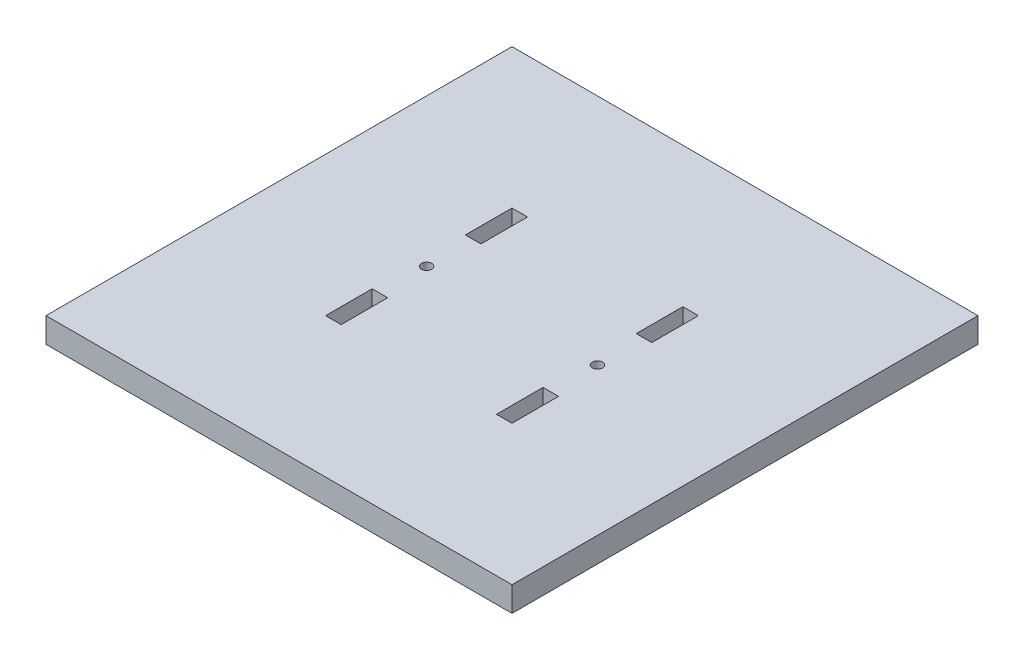
ISO-10303-21;
HEADER;
FILE_DESCRIPTION(('STEP AP214'),'2;1');
FILE_NAME('part.step','',(''),(''),'','','');
FILE_SCHEMA(('AUTOMOTIVE_DESIGN { 1 0 10303 214 1 1 1 1 }'));
ENDSEC;
DATA;
#1=APPLICATION_CONTEXT('core data for automotive mechanical design processes');
#2=APPLICATION_PROTOCOL_DEFINITION('international standard','automotive_design',2000,#1);
#3=PRODUCT_CONTEXT('',#1,'mechanical');
#4=PRODUCT('Part','Part','',(#3));
#5=PRODUCT_RELATED_PRODUCT_CATEGORY('part','',(#4));
#6=PRODUCT_DEFINITION_FORMATION('','',#4);
#7=PRODUCT_DEFINITION_CONTEXT('part definition',#1,'design');
#8=PRODUCT_DEFINITION('design','',#6,#7);
#9=PRODUCT_DEFINITION_SHAPE('','',#8);
#10=(LENGTH_UNIT() NAMED_UNIT(*) SI_UNIT(.MILLI.,.METRE.));
#11=(NAMED_UNIT(*) PLANE_ANGLE_UNIT() SI_UNIT($,.RADIAN.));
#12=(NAMED_UNIT(*) SI_UNIT($,.STERADIAN.) SOLID_ANGLE_UNIT());
#13=UNCERTAINTY_MEASURE_WITH_UNIT(LENGTH_MEASURE(1.E-05),#10,'distance_accuracy_value','');
#14=(GEOMETRIC_REPRESENTATION_CONTEXT(3) GLOBAL_UNCERTAINTY_ASSIGNED_CONTEXT((#13)) GLOBAL_UNIT_ASSIGNED_CONTEXT((#10,
#11,#12)) REPRESENTATION_CONTEXT('',''));
#15=CARTESIAN_POINT('',(0.,0.,0.));
#16=DIRECTION('',(0.,0.,1.));
#17=DIRECTION('',(1.,0.,0.));
#18=AXIS2_PLACEMENT_3D('',#15,#16,#17);
#19=CARTESIAN_POINT('',(0.,8.,-150.));
#20=DIRECTION('',(0.,-1.,0.));
#21=DIRECTION('',(0.,0.,-1.));
#22=AXIS2_PLACEMENT_3D('',#19,#20,#21);
#23=PLANE('',#22);
#24=DIRECTION('',(0.,0.,-1.));
#25=VECTOR('',#24,1.);
#26=CARTESIAN_POINT('',(50.,8.,-45.));
#27=LINE('',#26,#25);
#28=CARTESIAN_POINT('',(50.,8.,-45.));
#29=VERTEX_POINT('',#28);
#30=CARTESIAN_POINT('',(50.,8.,-60.));
#31=VERTEX_POINT('',#30);
#32=EDGE_CURVE('E203',#29,#31,#27,.T.);
#33=ORIENTED_EDGE('',*,*,#32,.F.);
#34=DIRECTION('',(1.,0.,0.));
#35=VECTOR('',#34,1.);
#36=CARTESIAN_POINT('',(50.,8.,-45.));
#37=LINE('',#36,#35);
#38=CARTESIAN_POINT('',(45.,8.,-45.));
#39=VERTEX_POINT('',#38);
#40=EDGE_CURVE('E211',#39,#29,#37,.T.);
#41=ORIENTED_EDGE('',*,*,#40,.F.);
#42=DIRECTION('',(0.,0.,1.));
#43=VECTOR('',#42,1.);
#44=CARTESIAN_POINT('',(45.,8.,-45.));
#45=LINE('',#44,#43);
#46=CARTESIAN_POINT('',(45.,8.,-60.));
#47=VERTEX_POINT('',#46);
#48=EDGE_CURVE('E208',#47,#39,#45,.T.);
#49=ORIENTED_EDGE('',*,*,#48,.F.);
#50=DIRECTION('',(-1.,0.,0.));
#51=VECTOR('',#50,1.);
#52=CARTESIAN_POINT('',(50.,8.,-60.));
#53=LINE('',#52,#51);
#54=EDGE_CURVE('E205',#31,#47,#53,.T.);
#55=ORIENTED_EDGE('',*,*,#54,.F.);
#56=EDGE_LOOP('',(#33,#41,#49,#55));
#57=FACE_BOUND('',#56,.T.);
#58=DIRECTION('',(1.,0.,0.));
#59=VECTOR('',#58,1.);
#60=CARTESIAN_POINT('',(100.,8.,-45.));
#61=LINE('',#60,#59);
#62=CARTESIAN_POINT('',(100.,8.,-45.));
#63=VERTEX_POINT('',#62);
#64=CARTESIAN_POINT('',(105.,8.,-45.));
#65=VERTEX_POINT('',#64);
#66=EDGE_CURVE('E240',#63,#65,#61,.T.);
#67=ORIENTED_EDGE('',*,*,#66,.F.);
#68=DIRECTION('',(0.,0.,1.));
#69=VECTOR('',#68,1.);
#70=CARTESIAN_POINT('',(100.,8.,-45.));
#71=LINE('',#70,#69);
#72=CARTESIAN_POINT('',(100.,8.,-60.));
#73=VERTEX_POINT('',#72);
#74=EDGE_CURVE('E248',#73,#63,#71,.T.);
#75=ORIENTED_EDGE('',*,*,#74,.F.);
#76=DIRECTION('',(-1.,0.,0.));
#77=VECTOR('',#76,1.);
#78=CARTESIAN_POINT('',(100.,8.,-60.));
#79=LINE('',#78,#77);
#80=CARTESIAN_POINT('',(105.,8.,-60.));
#81=VERTEX_POINT('',#80);
#82=EDGE_CURVE('E245',#81,#73,#79,.T.);
#83=ORIENTED_EDGE('',*,*,#82,.F.);
#84=DIRECTION('',(0.,0.,-1.));
#85=VECTOR('',#84,1.);
#86=CARTESIAN_POINT('',(105.,8.,-45.));
#87=LINE('',#86,#85);
#88=EDGE_CURVE('E242',#65,#81,#87,.T.);
#89=ORIENTED_EDGE('',*,*,#88,.F.);
#90=EDGE_LOOP('',(#67,#75,#83,#89));
#91=FACE_BOUND('',#90,.T.);
#92=DIRECTION('',(0.,0.,1.));
#93=VECTOR('',#92,1.);
#94=CARTESIAN_POINT('',(100.,8.,-105.));
#95=LINE('',#94,#93);
#96=CARTESIAN_POINT('',(100.,8.,-105.));
#97=VERTEX_POINT('',#96);
#98=CARTESIAN_POINT('',(100.,8.,-90.));
#99=VERTEX_POINT('',#98);
#100=EDGE_CURVE('E277',#97,#99,#95,.T.);
#101=ORIENTED_EDGE('',*,*,#100,.F.);
#102=DIRECTION('',(-1.,0.,0.));
#103=VECTOR('',#102,1.);
#104=CARTESIAN_POINT('',(100.,8.,-105.));
#105=LINE('',#104,#103);
#106=CARTESIAN_POINT('',(105.,8.,-105.));
#107=VERTEX_POINT('',#106);
#108=EDGE_CURVE('E285',#107,#97,#105,.T.);
#109=ORIENTED_EDGE('',*,*,#108,.F.);
#110=DIRECTION('',(0.,0.,-1.));
#111=VECTOR('',#110,1.);
#112=CARTESIAN_POINT('',(105.,8.,-105.));
#113=LINE('',#112,#111);
#114=CARTESIAN_POINT('',(105.,8.,-90.));
#115=VERTEX_POINT('',#114);
#116=EDGE_CURVE('E282',#115,#107,#113,.T.);
#117=ORIENTED_EDGE('',*,*,#116,.F.);
#118=DIRECTION('',(1.,0.,0.));
#119=VECTOR('',#118,1.);
#120=CARTESIAN_POINT('',(100.,8.,-90.));
#121=LINE('',#120,#119);
#122=EDGE_CURVE('E279',#99,#115,#121,.T.);
#123=ORIENTED_EDGE('',*,*,#122,.F.);
#124=EDGE_LOOP('',(#101,#109,#117,#123));
#125=FACE_BOUND('',#124,.T.);
#126=DIRECTION('',(0.,0.,1.));
#127=VECTOR('',#126,1.);
#128=CARTESIAN_POINT('',(0.,8.,0.));
#129=LINE('',#128,#127);
#130=CARTESIAN_POINT('',(0.,8.,-150.));
#131=VERTEX_POINT('',#130);
#132=CARTESIAN_POINT('',(0.,8.,0.));
#133=VERTEX_POINT('',#132);
#134=EDGE_CURVE('E308',#131,#133,#129,.T.);
#135=ORIENTED_EDGE('',*,*,#134,.T.);
#136=DIRECTION('',(1.,0.,0.));
#137=VECTOR('',#136,1.);
#138=CARTESIAN_POINT('',(0.,8.,0.));
#139=LINE('',#138,#137);
#140=CARTESIAN_POINT('',(150.,8.,0.));
#141=VERTEX_POINT('',#140);
#142=EDGE_CURVE('E311',#133,#141,#139,.T.);
#143=ORIENTED_EDGE('',*,*,#142,.T.);
#144=DIRECTION('',(0.,0.,-1.));
#145=VECTOR('',#144,1.);
#146=CARTESIAN_POINT('',(150.,8.,0.));
#147=LINE('',#146,#145);
#148=CARTESIAN_POINT('',(150.,8.,-150.));
#149=VERTEX_POINT('',#148);
#150=EDGE_CURVE('E314',#141,#149,#147,.T.);
#151=ORIENTED_EDGE('',*,*,#150,.T.);
#152=DIRECTION('',(-1.,0.,0.));
#153=VECTOR('',#152,1.);
#154=CARTESIAN_POINT('',(0.,8.,-150.));
#155=LINE('',#154,#153);
#156=EDGE_CURVE('E316',#149,#131,#155,.T.);
#157=ORIENTED_EDGE('',*,*,#156,.T.);
#158=EDGE_LOOP('',(#135,#143,#151,#157));
#159=FACE_BOUND('',#158,.T.);
#160=CARTESIAN_POINT('',(102.5,8.,-75.));
#161=DIRECTION('',(0.,1.,0.));
#162=DIRECTION('',(0.,0.,1.));
#163=AXIS2_PLACEMENT_3D('',#160,#161,#162);
#164=CIRCLE('',#163,1.65);
#165=CARTESIAN_POINT('',(102.5,8.,-73.35));
#166=VERTEX_POINT('',#165);
#167=EDGE_CURVE('E271',#166,#166,#164,.T.);
#168=ORIENTED_EDGE('',*,*,#167,.F.);
#169=EDGE_LOOP('',(#168));
#170=FACE_BOUND('',#169,.T.);
#171=CARTESIAN_POINT('',(47.5,8.,-75.));
#172=DIRECTION('',(0.,1.,0.));
#173=DIRECTION('',(0.,0.,-1.));
#174=AXIS2_PLACEMENT_3D('',#171,#172,#173);
#175=CIRCLE('',#174,1.65);
#176=CARTESIAN_POINT('',(47.5,8.,-76.65));
#177=VERTEX_POINT('',#176);
#178=EDGE_CURVE('E234',#177,#177,#175,.T.);
#179=ORIENTED_EDGE('',*,*,#178,.F.);
#180=EDGE_LOOP('',(#179));
#181=FACE_BOUND('',#180,.T.);
#182=DIRECTION('',(-1.,0.,0.));
#183=VECTOR('',#182,1.);
#184=CARTESIAN_POINT('',(50.,8.,-105.));
#185=LINE('',#184,#183);
#186=CARTESIAN_POINT('',(50.,8.,-105.));
#187=VERTEX_POINT('',#186);
#188=CARTESIAN_POINT('',(45.,8.,-105.));
#189=VERTEX_POINT('',#188);
#190=EDGE_CURVE('E167',#187,#189,#185,.T.);
#191=ORIENTED_EDGE('',*,*,#190,.F.);
#192=DIRECTION('',(0.,0.,-1.));
#193=VECTOR('',#192,1.);
#194=CARTESIAN_POINT('',(50.,8.,-105.));
#195=LINE('',#194,#193);
#196=CARTESIAN_POINT('',(50.,8.,-90.));
#197=VERTEX_POINT('',#196);
#198=EDGE_CURVE('E189',#197,#187,#195,.T.);
#199=ORIENTED_EDGE('',*,*,#198,.F.);
#200=DIRECTION('',(1.,0.,0.));
#201=VECTOR('',#200,1.);
#202=CARTESIAN_POINT('',(50.,8.,-90.));
#203=LINE('',#202,#201);
#204=CARTESIAN_POINT('',(45.,8.,-90.));
#205=VERTEX_POINT('',#204);
#206=EDGE_CURVE('E187',#205,#197,#203,.T.);
#207=ORIENTED_EDGE('',*,*,#206,.F.);
#208=DIRECTION('',(0.,0.,1.));
#209=VECTOR('',#208,1.);
#210=CARTESIAN_POINT('',(45.,8.,-105.));
#211=LINE('',#210,#209);
#212=EDGE_CURVE('E175',#189,#205,#211,.T.);
#213=ORIENTED_EDGE('',*,*,#212,.F.);
#214=EDGE_LOOP('',(#191,#199,#207,#213));
#215=FACE_BOUND('',#214,.T.);
#216=ADVANCED_FACE('F30',(#57,#91,#125,#159,#170,#181,#215),#23,.F.);
#217=CARTESIAN_POINT('',(0.,0.,-150.));
#218=DIRECTION('',(0.,-1.,0.));
#219=DIRECTION('',(0.,0.,-1.));
#220=AXIS2_PLACEMENT_3D('',#217,#218,#219);
#221=PLANE('',#220);
#222=DIRECTION('',(1.,0.,0.));
#223=VECTOR('',#222,1.);
#224=CARTESIAN_POINT('',(50.,0.,-45.));
#225=LINE('',#224,#223);
#226=CARTESIAN_POINT('',(45.,0.,-45.));
#227=VERTEX_POINT('',#226);
#228=CARTESIAN_POINT('',(50.,0.,-45.));
#229=VERTEX_POINT('',#228);
#230=EDGE_CURVE('E206',#227,#229,#225,.T.);
#231=ORIENTED_EDGE('',*,*,#230,.T.);
#232=DIRECTION('',(0.,0.,-1.));
#233=VECTOR('',#232,1.);
#234=CARTESIAN_POINT('',(50.,0.,-45.));
#235=LINE('',#234,#233);
#236=CARTESIAN_POINT('',(50.,0.,-60.));
#237=VERTEX_POINT('',#236);
#238=EDGE_CURVE('E183',#229,#237,#235,.T.);
#239=ORIENTED_EDGE('',*,*,#238,.T.);
#240=DIRECTION('',(-1.,0.,0.));
#241=VECTOR('',#240,1.);
#242=CARTESIAN_POINT('',(50.,0.,-60.));
#243=LINE('',#242,#241);
#244=CARTESIAN_POINT('',(45.,0.,-60.));
#245=VERTEX_POINT('',#244);
#246=EDGE_CURVE('E216',#237,#245,#243,.T.);
#247=ORIENTED_EDGE('',*,*,#246,.T.);
#248=DIRECTION('',(0.,0.,1.));
#249=VECTOR('',#248,1.);
#250=CARTESIAN_POINT('',(45.,0.,-45.));
#251=LINE('',#250,#249);
#252=EDGE_CURVE('E219',#245,#227,#251,.T.);
#253=ORIENTED_EDGE('',*,*,#252,.T.);
#254=EDGE_LOOP('',(#231,#239,#247,#253));
#255=FACE_BOUND('',#254,.T.);
#256=DIRECTION('',(0.,0.,1.));
#257=VECTOR('',#256,1.);
#258=CARTESIAN_POINT('',(100.,0.,-45.));
#259=LINE('',#258,#257);
#260=CARTESIAN_POINT('',(100.,0.,-60.));
#261=VERTEX_POINT('',#260);
#262=CARTESIAN_POINT('',(100.,0.,-45.));
#263=VERTEX_POINT('',#262);
#264=EDGE_CURVE('E243',#261,#263,#259,.T.);
#265=ORIENTED_EDGE('',*,*,#264,.T.);
#266=DIRECTION('',(1.,0.,0.));
#267=VECTOR('',#266,1.);
#268=CARTESIAN_POINT('',(100.,0.,-45.));
#269=LINE('',#268,#267);
#270=CARTESIAN_POINT('',(105.,0.,-45.));
#271=VERTEX_POINT('',#270);
#272=EDGE_CURVE('E237',#263,#271,#269,.T.);
#273=ORIENTED_EDGE('',*,*,#272,.T.);
#274=DIRECTION('',(0.,0.,-1.));
#275=VECTOR('',#274,1.);
#276=CARTESIAN_POINT('',(105.,0.,-45.));
#277=LINE('',#276,#275);
#278=CARTESIAN_POINT('',(105.,0.,-60.));
#279=VERTEX_POINT('',#278);
#280=EDGE_CURVE('E253',#271,#279,#277,.T.);
#281=ORIENTED_EDGE('',*,*,#280,.T.);
#282=DIRECTION('',(-1.,0.,0.));
#283=VECTOR('',#282,1.);
#284=CARTESIAN_POINT('',(100.,0.,-60.));
#285=LINE('',#284,#283);
#286=EDGE_CURVE('E256',#279,#261,#285,.T.);
#287=ORIENTED_EDGE('',*,*,#286,.T.);
#288=EDGE_LOOP('',(#265,#273,#281,#287));
#289=FACE_BOUND('',#288,.T.);
#290=DIRECTION('',(-1.,0.,0.));
#291=VECTOR('',#290,1.);
#292=CARTESIAN_POINT('',(100.,0.,-105.));
#293=LINE('',#292,#291);
#294=CARTESIAN_POINT('',(105.,0.,-105.));
#295=VERTEX_POINT('',#294);
#296=CARTESIAN_POINT('',(100.,0.,-105.));
#297=VERTEX_POINT('',#296);
#298=EDGE_CURVE('E280',#295,#297,#293,.T.);
#299=ORIENTED_EDGE('',*,*,#298,.T.);
#300=DIRECTION('',(0.,0.,1.));
#301=VECTOR('',#300,1.);
#302=CARTESIAN_POINT('',(100.,0.,-105.));
#303=LINE('',#302,#301);
#304=CARTESIAN_POINT('',(100.,0.,-90.));
#305=VERTEX_POINT('',#304);
#306=EDGE_CURVE('E274',#297,#305,#303,.T.);
#307=ORIENTED_EDGE('',*,*,#306,.T.);
#308=DIRECTION('',(1.,0.,0.));
#309=VECTOR('',#308,1.);
#310=CARTESIAN_POINT('',(100.,0.,-90.));
#311=LINE('',#310,#309);
#312=CARTESIAN_POINT('',(105.,0.,-90.));
#313=VERTEX_POINT('',#312);
#314=EDGE_CURVE('E290',#305,#313,#311,.T.);
#315=ORIENTED_EDGE('',*,*,#314,.T.);
#316=DIRECTION('',(0.,0.,-1.));
#317=VECTOR('',#316,1.);
#318=CARTESIAN_POINT('',(105.,0.,-105.));
#319=LINE('',#318,#317);
#320=EDGE_CURVE('E293',#313,#295,#319,.T.);
#321=ORIENTED_EDGE('',*,*,#320,.T.);
#322=EDGE_LOOP('',(#299,#307,#315,#321));
#323=FACE_BOUND('',#322,.T.);
#324=DIRECTION('',(0.,0.,1.));
#325=VECTOR('',#324,1.);
#326=CARTESIAN_POINT('',(0.,0.,0.));
#327=LINE('',#326,#325);
#328=CARTESIAN_POINT('',(0.,0.,-150.));
#329=VERTEX_POINT('',#328);
#330=CARTESIAN_POINT('',(0.,0.,0.));
#331=VERTEX_POINT('',#330);
#332=EDGE_CURVE('E307',#329,#331,#327,.T.);
#333=ORIENTED_EDGE('',*,*,#332,.F.);
#334=DIRECTION('',(-1.,0.,0.));
#335=VECTOR('',#334,1.);
#336=CARTESIAN_POINT('',(0.,0.,-150.));
#337=LINE('',#336,#335);
#338=CARTESIAN_POINT('',(150.,0.,-150.));
#339=VERTEX_POINT('',#338);
#340=EDGE_CURVE('E312',#339,#329,#337,.T.);
#341=ORIENTED_EDGE('',*,*,#340,.F.);
#342=DIRECTION('',(0.,0.,-1.));
#343=VECTOR('',#342,1.);
#344=CARTESIAN_POINT('',(150.,0.,0.));
#345=LINE('',#344,#343);
#346=CARTESIAN_POINT('',(150.,0.,0.));
#347=VERTEX_POINT('',#346);
#348=EDGE_CURVE('E323',#347,#339,#345,.T.);
#349=ORIENTED_EDGE('',*,*,#348,.F.);
#350=DIRECTION('',(1.,0.,0.));
#351=VECTOR('',#350,1.);
#352=CARTESIAN_POINT('',(0.,0.,0.));
#353=LINE('',#352,#351);
#354=EDGE_CURVE('E321',#331,#347,#353,.T.);
#355=ORIENTED_EDGE('',*,*,#354,.F.);
#356=EDGE_LOOP('',(#333,#341,#349,#355));
#357=FACE_BOUND('',#356,.T.);
#358=CARTESIAN_POINT('',(102.5,0.,-75.));
#359=DIRECTION('',(0.,1.,0.));
#360=DIRECTION('',(0.,0.,1.));
#361=AXIS2_PLACEMENT_3D('',#358,#359,#360);
#362=CIRCLE('',#361,1.65);
#363=CARTESIAN_POINT('',(102.5,0.,-73.35));
#364=VERTEX_POINT('',#363);
#365=EDGE_CURVE('E270',#364,#364,#362,.T.);
#366=ORIENTED_EDGE('',*,*,#365,.T.);
#367=EDGE_LOOP('',(#366));
#368=FACE_BOUND('',#367,.T.);
#369=CARTESIAN_POINT('',(47.5,0.,-75.));
#370=DIRECTION('',(0.,1.,0.));
#371=DIRECTION('',(0.,0.,-1.));
#372=AXIS2_PLACEMENT_3D('',#369,#370,#371);
#373=CIRCLE('',#372,1.65);
#374=CARTESIAN_POINT('',(47.5,0.,-76.65));
#375=VERTEX_POINT('',#374);
#376=EDGE_CURVE('E233',#375,#375,#373,.T.);
#377=ORIENTED_EDGE('',*,*,#376,.T.);
#378=EDGE_LOOP('',(#377));
#379=FACE_BOUND('',#378,.T.);
#380=DIRECTION('',(0.,0.,-1.));
#381=VECTOR('',#380,1.);
#382=CARTESIAN_POINT('',(50.,0.,-105.));
#383=LINE('',#382,#381);
#384=CARTESIAN_POINT('',(50.,0.,-90.));
#385=VERTEX_POINT('',#384);
#386=CARTESIAN_POINT('',(50.,0.,-105.));
#387=VERTEX_POINT('',#386);
#388=EDGE_CURVE('E176',#385,#387,#383,.T.);
#389=ORIENTED_EDGE('',*,*,#388,.T.);
#390=DIRECTION('',(-1.,0.,0.));
#391=VECTOR('',#390,1.);
#392=CARTESIAN_POINT('',(50.,0.,-105.));
#393=LINE('',#392,#391);
#394=CARTESIAN_POINT('',(45.,0.,-105.));
#395=VERTEX_POINT('',#394);
#396=EDGE_CURVE('E53',#387,#395,#393,.T.);
#397=ORIENTED_EDGE('',*,*,#396,.T.);
#398=DIRECTION('',(0.,0.,1.));
#399=VECTOR('',#398,1.);
#400=CARTESIAN_POINT('',(45.,0.,-105.));
#401=LINE('',#400,#399);
#402=CARTESIAN_POINT('',(45.,0.,-90.));
#403=VERTEX_POINT('',#402);
#404=EDGE_CURVE('E182',#395,#403,#401,.T.);
#405=ORIENTED_EDGE('',*,*,#404,.T.);
#406=DIRECTION('',(1.,0.,0.));
#407=VECTOR('',#406,1.);
#408=CARTESIAN_POINT('',(50.,0.,-90.));
#409=LINE('',#408,#407);
#410=EDGE_CURVE('E195',#403,#385,#409,.T.);
#411=ORIENTED_EDGE('',*,*,#410,.T.);
#412=EDGE_LOOP('',(#389,#397,#405,#411));
#413=FACE_BOUND('',#412,.T.);
#414=ADVANCED_FACE('F341',(#255,#289,#323,#357,#368,#379,#413),#221,.T.);
#415=CARTESIAN_POINT('',(0.,8.,0.));
#416=DIRECTION('',(1.,0.,0.));
#417=DIRECTION('',(0.,0.,-1.));
#418=AXIS2_PLACEMENT_3D('',#415,#416,#417);
#419=PLANE('',#418);
#420=ORIENTED_EDGE('',*,*,#332,.T.);
#421=DIRECTION('',(0.,-1.,0.));
#422=VECTOR('',#421,1.);
#423=CARTESIAN_POINT('',(0.,8.,0.));
#424=LINE('',#423,#422);
#425=EDGE_CURVE('E11',#133,#331,#424,.T.);
#426=ORIENTED_EDGE('',*,*,#425,.F.);
#427=ORIENTED_EDGE('',*,*,#134,.F.);
#428=DIRECTION('',(0.,-1.,0.));
#429=VECTOR('',#428,1.);
#430=CARTESIAN_POINT('',(0.,8.,-150.));
#431=LINE('',#430,#429);
#432=EDGE_CURVE('E318',#131,#329,#431,.T.);
#433=ORIENTED_EDGE('',*,*,#432,.T.);
#434=EDGE_LOOP('',(#420,#426,#427,#433));
#435=FACE_BOUND('',#434,.T.);
#436=ADVANCED_FACE('F32',(#435),#419,.F.);
#437=CARTESIAN_POINT('',(0.,8.,0.));
#438=DIRECTION('',(0.,0.,-1.));
#439=DIRECTION('',(-1.,0.,0.));
#440=AXIS2_PLACEMENT_3D('',#437,#438,#439);
#441=PLANE('',#440);
#442=ORIENTED_EDGE('',*,*,#354,.T.);
#443=DIRECTION('',(0.,-1.,0.));
#444=VECTOR('',#443,1.);
#445=CARTESIAN_POINT('',(150.,8.,0.));
#446=LINE('',#445,#444);
#447=EDGE_CURVE('E38',#141,#347,#446,.T.);
#448=ORIENTED_EDGE('',*,*,#447,.F.);
#449=ORIENTED_EDGE('',*,*,#142,.F.);
#450=ORIENTED_EDGE('',*,*,#425,.T.);
#451=EDGE_LOOP('',(#442,#448,#449,#450));
#452=FACE_BOUND('',#451,.T.);
#453=ADVANCED_FACE('F352',(#452),#441,.F.);
#454=CARTESIAN_POINT('',(150.,8.,0.));
#455=DIRECTION('',(-1.,0.,0.));
#456=DIRECTION('',(0.,0.,1.));
#457=AXIS2_PLACEMENT_3D('',#454,#455,#456);
#458=PLANE('',#457);
#459=ORIENTED_EDGE('',*,*,#348,.T.);
#460=DIRECTION('',(0.,-1.,0.));
#461=VECTOR('',#460,1.);
#462=CARTESIAN_POINT('',(150.,8.,-150.));
#463=LINE('',#462,#461);
#464=EDGE_CURVE('E328',#149,#339,#463,.T.);
#465=ORIENTED_EDGE('',*,*,#464,.F.);
#466=ORIENTED_EDGE('',*,*,#150,.F.);
#467=ORIENTED_EDGE('',*,*,#447,.T.);
#468=EDGE_LOOP('',(#459,#465,#466,#467));
#469=FACE_BOUND('',#468,.T.);
#470=ADVANCED_FACE('F335',(#469),#458,.F.);
#471=CARTESIAN_POINT('',(0.,8.,-150.));
#472=DIRECTION('',(0.,0.,1.));
#473=DIRECTION('',(1.,0.,0.));
#474=AXIS2_PLACEMENT_3D('',#471,#472,#473);
#475=PLANE('',#474);
#476=ORIENTED_EDGE('',*,*,#340,.T.);
#477=ORIENTED_EDGE('',*,*,#432,.F.);
#478=ORIENTED_EDGE('',*,*,#156,.F.);
#479=ORIENTED_EDGE('',*,*,#464,.T.);
#480=EDGE_LOOP('',(#476,#477,#478,#479));
#481=FACE_BOUND('',#480,.T.);
#482=ADVANCED_FACE('F345',(#481),#475,.F.);
#483=CARTESIAN_POINT('',(100.,8.,-105.));
#484=DIRECTION('',(1.,0.,0.));
#485=DIRECTION('',(0.,0.,-1.));
#486=AXIS2_PLACEMENT_3D('',#483,#484,#485);
#487=PLANE('',#486);
#488=ORIENTED_EDGE('',*,*,#306,.F.);
#489=DIRECTION('',(0.,-1.,0.));
#490=VECTOR('',#489,1.);
#491=CARTESIAN_POINT('',(100.,8.,-105.));
#492=LINE('',#491,#490);
#493=EDGE_CURVE('E287',#97,#297,#492,.T.);
#494=ORIENTED_EDGE('',*,*,#493,.F.);
#495=ORIENTED_EDGE('',*,*,#100,.T.);
#496=DIRECTION('',(0.,-1.,0.));
#497=VECTOR('',#496,1.);
#498=CARTESIAN_POINT('',(100.,8.,-90.));
#499=LINE('',#498,#497);
#500=EDGE_CURVE('E304',#99,#305,#499,.T.);
#501=ORIENTED_EDGE('',*,*,#500,.T.);
#502=EDGE_LOOP('',(#488,#494,#495,#501));
#503=FACE_BOUND('',#502,.T.);
#504=ADVANCED_FACE('F370',(#503),#487,.T.);
#505=CARTESIAN_POINT('',(100.,8.,-90.));
#506=DIRECTION('',(0.,0.,-1.));
#507=DIRECTION('',(-1.,0.,0.));
#508=AXIS2_PLACEMENT_3D('',#505,#506,#507);
#509=PLANE('',#508);
#510=ORIENTED_EDGE('',*,*,#314,.F.);
#511=ORIENTED_EDGE('',*,*,#500,.F.);
#512=ORIENTED_EDGE('',*,*,#122,.T.);
#513=DIRECTION('',(0.,-1.,0.));
#514=VECTOR('',#513,1.);
#515=CARTESIAN_POINT('',(105.,8.,-90.));
#516=LINE('',#515,#514);
#517=EDGE_CURVE('E302',#115,#313,#516,.T.);
#518=ORIENTED_EDGE('',*,*,#517,.T.);
#519=EDGE_LOOP('',(#510,#511,#512,#518));
#520=FACE_BOUND('',#519,.T.);
#521=ADVANCED_FACE('F377',(#520),#509,.T.);
#522=CARTESIAN_POINT('',(105.,8.,-105.));
#523=DIRECTION('',(-1.,0.,0.));
#524=DIRECTION('',(0.,0.,1.));
#525=AXIS2_PLACEMENT_3D('',#522,#523,#524);
#526=PLANE('',#525);
#527=ORIENTED_EDGE('',*,*,#320,.F.);
#528=ORIENTED_EDGE('',*,*,#517,.F.);
#529=ORIENTED_EDGE('',*,*,#116,.T.);
#530=DIRECTION('',(0.,-1.,0.));
#531=VECTOR('',#530,1.);
#532=CARTESIAN_POINT('',(105.,8.,-105.));
#533=LINE('',#532,#531);
#534=EDGE_CURVE('E300',#107,#295,#533,.T.);
#535=ORIENTED_EDGE('',*,*,#534,.T.);
#536=EDGE_LOOP('',(#527,#528,#529,#535));
#537=FACE_BOUND('',#536,.T.);
#538=ADVANCED_FACE('F382',(#537),#526,.T.);
#539=CARTESIAN_POINT('',(100.,8.,-105.));
#540=DIRECTION('',(0.,0.,1.));
#541=DIRECTION('',(1.,0.,0.));
#542=AXIS2_PLACEMENT_3D('',#539,#540,#541);
#543=PLANE('',#542);
#544=ORIENTED_EDGE('',*,*,#298,.F.);
#545=ORIENTED_EDGE('',*,*,#534,.F.);
#546=ORIENTED_EDGE('',*,*,#108,.T.);
#547=ORIENTED_EDGE('',*,*,#493,.T.);
#548=EDGE_LOOP('',(#544,#545,#546,#547));
#549=FACE_BOUND('',#548,.T.);
#550=ADVANCED_FACE('F390',(#549),#543,.T.);
#551=CARTESIAN_POINT('',(102.5,8.,-75.));
#552=DIRECTION('',(0.,-1.,0.));
#553=DIRECTION('',(0.,0.,-1.));
#554=AXIS2_PLACEMENT_3D('',#551,#552,#553);
#555=CYLINDRICAL_SURFACE('',#554,1.65);
#556=ORIENTED_EDGE('',*,*,#167,.T.);
#557=EDGE_LOOP('',(#556));
#558=FACE_BOUND('',#557,.T.);
#559=ORIENTED_EDGE('',*,*,#365,.F.);
#560=EDGE_LOOP('',(#559));
#561=FACE_BOUND('',#560,.T.);
#562=ADVANCED_FACE('F403',(#558,#561),#555,.F.);
#563=CARTESIAN_POINT('',(100.,8.,-45.));
#564=DIRECTION('',(0.,0.,-1.));
#565=DIRECTION('',(-1.,0.,0.));
#566=AXIS2_PLACEMENT_3D('',#563,#564,#565);
#567=PLANE('',#566);
#568=ORIENTED_EDGE('',*,*,#272,.F.);
#569=DIRECTION('',(0.,-1.,0.));
#570=VECTOR('',#569,1.);
#571=CARTESIAN_POINT('',(100.,8.,-45.));
#572=LINE('',#571,#570);
#573=EDGE_CURVE('E250',#63,#263,#572,.T.);
#574=ORIENTED_EDGE('',*,*,#573,.F.);
#575=ORIENTED_EDGE('',*,*,#66,.T.);
#576=DIRECTION('',(0.,-1.,0.));
#577=VECTOR('',#576,1.);
#578=CARTESIAN_POINT('',(105.,8.,-45.));
#579=LINE('',#578,#577);
#580=EDGE_CURVE('E267',#65,#271,#579,.T.);
#581=ORIENTED_EDGE('',*,*,#580,.T.);
#582=EDGE_LOOP('',(#568,#574,#575,#581));
#583=FACE_BOUND('',#582,.T.);
#584=ADVANCED_FACE('F408',(#583),#567,.T.);
#585=CARTESIAN_POINT('',(105.,8.,-45.));
#586=DIRECTION('',(-1.,0.,0.));
#587=DIRECTION('',(0.,0.,1.));
#588=AXIS2_PLACEMENT_3D('',#585,#586,#587);
#589=PLANE('',#588);
#590=ORIENTED_EDGE('',*,*,#280,.F.);
#591=ORIENTED_EDGE('',*,*,#580,.F.);
#592=ORIENTED_EDGE('',*,*,#88,.T.);
#593=DIRECTION('',(0.,-1.,0.));
#594=VECTOR('',#593,1.);
#595=CARTESIAN_POINT('',(105.,8.,-60.));
#596=LINE('',#595,#594);
#597=EDGE_CURVE('E265',#81,#279,#596,.T.);
#598=ORIENTED_EDGE('',*,*,#597,.T.);
#599=EDGE_LOOP('',(#590,#591,#592,#598));
#600=FACE_BOUND('',#599,.T.);
#601=ADVANCED_FACE('F412',(#600),#589,.T.);
#602=CARTESIAN_POINT('',(100.,8.,-60.));
#603=DIRECTION('',(0.,0.,1.));
#604=DIRECTION('',(1.,0.,0.));
#605=AXIS2_PLACEMENT_3D('',#602,#603,#604);
#606=PLANE('',#605);
#607=ORIENTED_EDGE('',*,*,#286,.F.);
#608=ORIENTED_EDGE('',*,*,#597,.F.);
#609=ORIENTED_EDGE('',*,*,#82,.T.);
#610=DIRECTION('',(0.,-1.,0.));
#611=VECTOR('',#610,1.);
#612=CARTESIAN_POINT('',(100.,8.,-60.));
#613=LINE('',#612,#611);
#614=EDGE_CURVE('E263',#73,#261,#613,.T.);
#615=ORIENTED_EDGE('',*,*,#614,.T.);
#616=EDGE_LOOP('',(#607,#608,#609,#615));
#617=FACE_BOUND('',#616,.T.);
#618=ADVANCED_FACE('F416',(#617),#606,.T.);
#619=CARTESIAN_POINT('',(100.,8.,-45.));
#620=DIRECTION('',(1.,0.,0.));
#621=DIRECTION('',(0.,0.,-1.));
#622=AXIS2_PLACEMENT_3D('',#619,#620,#621);
#623=PLANE('',#622);
#624=ORIENTED_EDGE('',*,*,#264,.F.);
#625=ORIENTED_EDGE('',*,*,#614,.F.);
#626=ORIENTED_EDGE('',*,*,#74,.T.);
#627=ORIENTED_EDGE('',*,*,#573,.T.);
#628=EDGE_LOOP('',(#624,#625,#626,#627));
#629=FACE_BOUND('',#628,.T.);
#630=ADVANCED_FACE('F420',(#629),#623,.T.);
#631=CARTESIAN_POINT('',(47.5,8.,-75.));
#632=DIRECTION('',(0.,-1.,0.));
#633=DIRECTION('',(0.,0.,-1.));
#634=AXIS2_PLACEMENT_3D('',#631,#632,#633);
#635=CYLINDRICAL_SURFACE('',#634,1.65);
#636=ORIENTED_EDGE('',*,*,#178,.T.);
#637=EDGE_LOOP('',(#636));
#638=FACE_BOUND('',#637,.T.);
#639=ORIENTED_EDGE('',*,*,#376,.F.);
#640=EDGE_LOOP('',(#639));
#641=FACE_BOUND('',#640,.T.);
#642=ADVANCED_FACE('F424',(#638,#641),#635,.F.);
#643=CARTESIAN_POINT('',(50.,8.,-45.));
#644=DIRECTION('',(-1.,0.,0.));
#645=DIRECTION('',(0.,0.,1.));
#646=AXIS2_PLACEMENT_3D('',#643,#644,#645);
#647=PLANE('',#646);
#648=ORIENTED_EDGE('',*,*,#238,.F.);
#649=DIRECTION('',(0.,-1.,0.));
#650=VECTOR('',#649,1.);
#651=CARTESIAN_POINT('',(50.,8.,-45.));
#652=LINE('',#651,#650);
#653=EDGE_CURVE('E213',#29,#229,#652,.T.);
#654=ORIENTED_EDGE('',*,*,#653,.F.);
#655=ORIENTED_EDGE('',*,*,#32,.T.);
#656=DIRECTION('',(0.,-1.,0.));
#657=VECTOR('',#656,1.);
#658=CARTESIAN_POINT('',(50.,8.,-60.));
#659=LINE('',#658,#657);
#660=EDGE_CURVE('E230',#31,#237,#659,.T.);
#661=ORIENTED_EDGE('',*,*,#660,.T.);
#662=EDGE_LOOP('',(#648,#654,#655,#661));
#663=FACE_BOUND('',#662,.T.);
#664=ADVANCED_FACE('F428',(#663),#647,.T.);
#665=CARTESIAN_POINT('',(50.,8.,-60.));
#666=DIRECTION('',(0.,0.,1.));
#667=DIRECTION('',(1.,0.,0.));
#668=AXIS2_PLACEMENT_3D('',#665,#666,#667);
#669=PLANE('',#668);
#670=ORIENTED_EDGE('',*,*,#246,.F.);
#671=ORIENTED_EDGE('',*,*,#660,.F.);
#672=ORIENTED_EDGE('',*,*,#54,.T.);
#673=DIRECTION('',(0.,-1.,0.));
#674=VECTOR('',#673,1.);
#675=CARTESIAN_POINT('',(45.,8.,-60.));
#676=LINE('',#675,#674);
#677=EDGE_CURVE('E228',#47,#245,#676,.T.);
#678=ORIENTED_EDGE('',*,*,#677,.T.);
#679=EDGE_LOOP('',(#670,#671,#672,#678));
#680=FACE_BOUND('',#679,.T.);
#681=ADVANCED_FACE('F432',(#680),#669,.T.);
#682=CARTESIAN_POINT('',(45.,8.,-45.));
#683=DIRECTION('',(1.,0.,0.));
#684=DIRECTION('',(0.,0.,-1.));
#685=AXIS2_PLACEMENT_3D('',#682,#683,#684);
#686=PLANE('',#685);
#687=ORIENTED_EDGE('',*,*,#252,.F.);
#688=ORIENTED_EDGE('',*,*,#677,.F.);
#689=ORIENTED_EDGE('',*,*,#48,.T.);
#690=DIRECTION('',(0.,-1.,0.));
#691=VECTOR('',#690,1.);
#692=CARTESIAN_POINT('',(45.,8.,-45.));
#693=LINE('',#692,#691);
#694=EDGE_CURVE('E226',#39,#227,#693,.T.);
#695=ORIENTED_EDGE('',*,*,#694,.T.);
#696=EDGE_LOOP('',(#687,#688,#689,#695));
#697=FACE_BOUND('',#696,.T.);
#698=ADVANCED_FACE('F436',(#697),#686,.T.);
#699=CARTESIAN_POINT('',(50.,8.,-45.));
#700=DIRECTION('',(0.,0.,-1.));
#701=DIRECTION('',(-1.,0.,0.));
#702=AXIS2_PLACEMENT_3D('',#699,#700,#701);
#703=PLANE('',#702);
#704=ORIENTED_EDGE('',*,*,#230,.F.);
#705=ORIENTED_EDGE('',*,*,#694,.F.);
#706=ORIENTED_EDGE('',*,*,#40,.T.);
#707=ORIENTED_EDGE('',*,*,#653,.T.);
#708=EDGE_LOOP('',(#704,#705,#706,#707));
#709=FACE_BOUND('',#708,.T.);
#710=ADVANCED_FACE('F440',(#709),#703,.T.);
#711=CARTESIAN_POINT('',(50.,8.,-105.));
#712=DIRECTION('',(0.,0.,1.));
#713=DIRECTION('',(1.,0.,0.));
#714=AXIS2_PLACEMENT_3D('',#711,#712,#713);
#715=PLANE('',#714);
#716=ORIENTED_EDGE('',*,*,#396,.F.);
#717=DIRECTION('',(0.,-1.,0.));
#718=VECTOR('',#717,1.);
#719=CARTESIAN_POINT('',(50.,8.,-105.));
#720=LINE('',#719,#718);
#721=EDGE_CURVE('E171',#187,#387,#720,.T.);
#722=ORIENTED_EDGE('',*,*,#721,.F.);
#723=ORIENTED_EDGE('',*,*,#190,.T.);
#724=DIRECTION('',(0.,-1.,0.));
#725=VECTOR('',#724,1.);
#726=CARTESIAN_POINT('',(45.,8.,-105.));
#727=LINE('',#726,#725);
#728=EDGE_CURVE('E170',#189,#395,#727,.T.);
#729=ORIENTED_EDGE('',*,*,#728,.T.);
#730=EDGE_LOOP('',(#716,#722,#723,#729));
#731=FACE_BOUND('',#730,.T.);
#732=ADVANCED_FACE('F169',(#731),#715,.T.);
#733=CARTESIAN_POINT('',(45.,8.,-105.));
#734=DIRECTION('',(1.,0.,0.));
#735=DIRECTION('',(0.,0.,-1.));
#736=AXIS2_PLACEMENT_3D('',#733,#734,#735);
#737=PLANE('',#736);
#738=ORIENTED_EDGE('',*,*,#404,.F.);
#739=ORIENTED_EDGE('',*,*,#728,.F.);
#740=ORIENTED_EDGE('',*,*,#212,.T.);
#741=DIRECTION('',(0.,-1.,0.));
#742=VECTOR('',#741,1.);
#743=CARTESIAN_POINT('',(45.,8.,-90.));
#744=LINE('',#743,#742);
#745=EDGE_CURVE('E184',#205,#403,#744,.T.);
#746=ORIENTED_EDGE('',*,*,#745,.T.);
#747=EDGE_LOOP('',(#738,#739,#740,#746));
#748=FACE_BOUND('',#747,.T.);
#749=ADVANCED_FACE('F179',(#748),#737,.T.);
#750=CARTESIAN_POINT('',(50.,8.,-90.));
#751=DIRECTION('',(0.,0.,-1.));
#752=DIRECTION('',(-1.,0.,0.));
#753=AXIS2_PLACEMENT_3D('',#750,#751,#752);
#754=PLANE('',#753);
#755=ORIENTED_EDGE('',*,*,#410,.F.);
#756=ORIENTED_EDGE('',*,*,#745,.F.);
#757=ORIENTED_EDGE('',*,*,#206,.T.);
#758=DIRECTION('',(0.,-1.,0.));
#759=VECTOR('',#758,1.);
#760=CARTESIAN_POINT('',(50.,8.,-90.));
#761=LINE('',#760,#759);
#762=EDGE_CURVE('E45',#197,#385,#761,.T.);
#763=ORIENTED_EDGE('',*,*,#762,.T.);
#764=EDGE_LOOP('',(#755,#756,#757,#763));
#765=FACE_BOUND('',#764,.T.);
#766=ADVANCED_FACE('F449',(#765),#754,.T.);
#767=CARTESIAN_POINT('',(50.,8.,-105.));
#768=DIRECTION('',(-1.,0.,0.));
#769=DIRECTION('',(0.,0.,1.));
#770=AXIS2_PLACEMENT_3D('',#767,#768,#769);
#771=PLANE('',#770);
#772=ORIENTED_EDGE('',*,*,#388,.F.);
#773=ORIENTED_EDGE('',*,*,#762,.F.);
#774=ORIENTED_EDGE('',*,*,#198,.T.);
#775=ORIENTED_EDGE('',*,*,#721,.T.);
#776=EDGE_LOOP('',(#772,#773,#774,#775));
#777=FACE_BOUND('',#776,.T.);
#778=ADVANCED_FACE('F452',(#777),#771,.T.);
#779=CLOSED_SHELL('',(#216,#414,#436,#453,#470,#482,#504,#521,#538,#550,#562,#584,#601,#618,
#630,#642,#664,#681,#698,#710,#732,#749,#766,#778));
#780=MANIFOLD_SOLID_BREP('B2',#779);
#781=ADVANCED_BREP_SHAPE_REPRESENTATION('',(#18,#780),#14);
#782=SHAPE_DEFINITION_REPRESENTATION(#9,#781);
ENDSEC;
END-ISO-10303-21;
